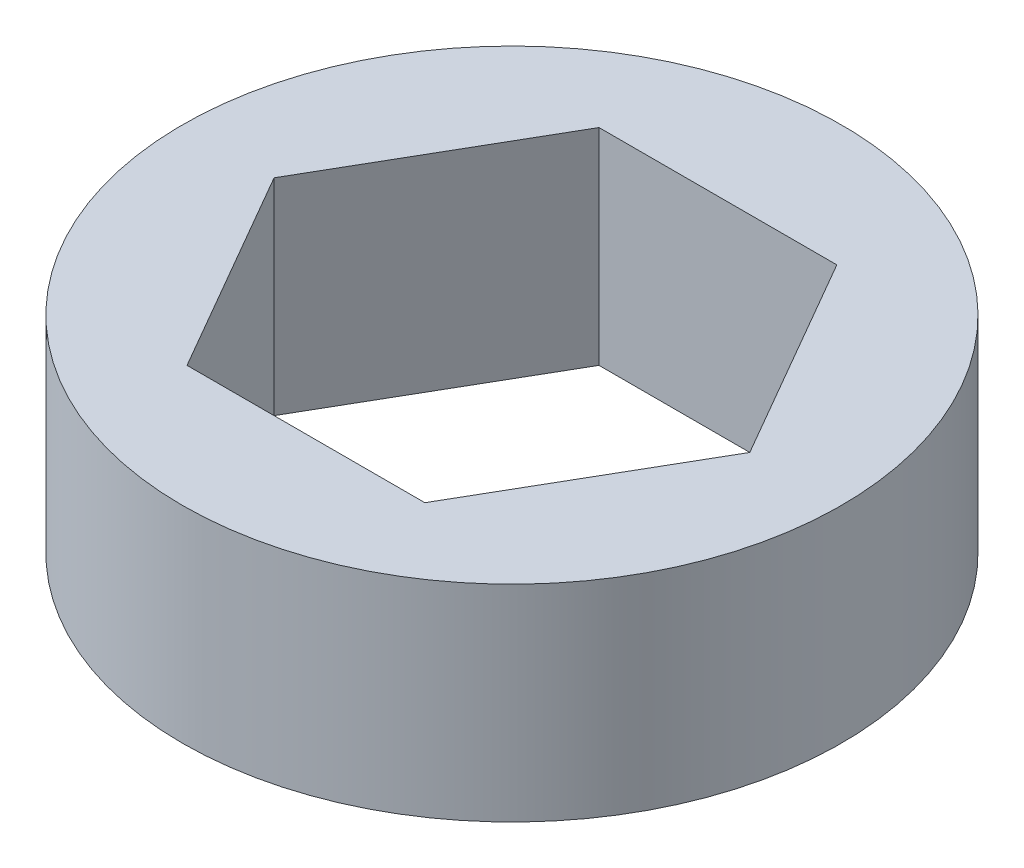
ISO-10303-21;
HEADER;
FILE_DESCRIPTION(('STEP AP214'),'2;1');
FILE_NAME('part.step','',(''),(''),'','','');
FILE_SCHEMA(('AUTOMOTIVE_DESIGN { 1 0 10303 214 1 1 1 1 }'));
ENDSEC;
DATA;
#1=APPLICATION_CONTEXT('core data for automotive mechanical design processes');
#2=APPLICATION_PROTOCOL_DEFINITION('international standard','automotive_design',2000,#1);
#3=PRODUCT_CONTEXT('',#1,'mechanical');
#4=PRODUCT('Part','Part','',(#3));
#5=PRODUCT_RELATED_PRODUCT_CATEGORY('part','',(#4));
#6=PRODUCT_DEFINITION_FORMATION('','',#4);
#7=PRODUCT_DEFINITION_CONTEXT('part definition',#1,'design');
#8=PRODUCT_DEFINITION('design','',#6,#7);
#9=PRODUCT_DEFINITION_SHAPE('','',#8);
#10=(LENGTH_UNIT() NAMED_UNIT(*) SI_UNIT(.MILLI.,.METRE.));
#11=(NAMED_UNIT(*) PLANE_ANGLE_UNIT() SI_UNIT($,.RADIAN.));
#12=(NAMED_UNIT(*) SI_UNIT($,.STERADIAN.) SOLID_ANGLE_UNIT());
#13=UNCERTAINTY_MEASURE_WITH_UNIT(LENGTH_MEASURE(1.E-05),#10,'distance_accuracy_value','');
#14=(GEOMETRIC_REPRESENTATION_CONTEXT(3) GLOBAL_UNCERTAINTY_ASSIGNED_CONTEXT((#13)) GLOBAL_UNIT_ASSIGNED_CONTEXT((#10,
#11,#12)) REPRESENTATION_CONTEXT('',''));
#15=CARTESIAN_POINT('',(0.,0.,0.));
#16=DIRECTION('',(0.,0.,1.));
#17=DIRECTION('',(1.,0.,0.));
#18=AXIS2_PLACEMENT_3D('',#15,#16,#17);
#19=CARTESIAN_POINT('',(0.,6.35,0.));
#20=DIRECTION('',(0.,1.,0.));
#21=DIRECTION('',(0.,0.,1.));
#22=AXIS2_PLACEMENT_3D('',#19,#20,#21);
#23=PLANE('',#22);
#24=CARTESIAN_POINT('',(0.,6.35,0.));
#25=DIRECTION('',(0.,1.,0.));
#26=DIRECTION('',(0.,0.,1.));
#27=AXIS2_PLACEMENT_3D('',#24,#25,#26);
#28=CIRCLE('',#27,10.16);
#29=CARTESIAN_POINT('',(0.,6.35,10.16));
#30=VERTEX_POINT('',#29);
#31=EDGE_CURVE('E11',#30,#30,#28,.T.);
#32=ORIENTED_EDGE('',*,*,#31,.T.);
#33=EDGE_LOOP('',(#32));
#34=FACE_BOUND('',#33,.T.);
#35=DIRECTION('',(-0.500000000000001,0.,-0.866025403784438));
#36=VECTOR('',#35,1.);
#37=CARTESIAN_POINT('',(7.33234841870825,6.35,0.));
#38=LINE('',#37,#36);
#39=CARTESIAN_POINT('',(7.33234841870825,6.35,0.));
#40=VERTEX_POINT('',#39);
#41=CARTESIAN_POINT('',(3.66617420935411,6.35,-6.35000000000001));
#42=VERTEX_POINT('',#41);
#43=EDGE_CURVE('E93',#40,#42,#38,.T.);
#44=ORIENTED_EDGE('',*,*,#43,.F.);
#45=DIRECTION('',(0.499999999999995,0.,-0.866025403784442));
#46=VECTOR('',#45,1.);
#47=CARTESIAN_POINT('',(3.6661742093542,6.35,6.34999999999996));
#48=LINE('',#47,#46);
#49=CARTESIAN_POINT('',(3.6661742093542,6.35,6.34999999999996));
#50=VERTEX_POINT('',#49);
#51=EDGE_CURVE('E85',#50,#40,#48,.T.);
#52=ORIENTED_EDGE('',*,*,#51,.F.);
#53=DIRECTION('',(1.,0.,0.));
#54=VECTOR('',#53,1.);
#55=CARTESIAN_POINT('',(-3.66617420935407,6.35,6.35000000000004));
#56=LINE('',#55,#54);
#57=CARTESIAN_POINT('',(-3.66617420935407,6.35,6.35000000000004));
#58=VERTEX_POINT('',#57);
#59=EDGE_CURVE('E113',#58,#50,#56,.T.);
#60=ORIENTED_EDGE('',*,*,#59,.F.);
#61=DIRECTION('',(0.500000000000007,0.,0.866025403784435));
#62=VECTOR('',#61,1.);
#63=CARTESIAN_POINT('',(-7.33234841870825,6.35,0.));
#64=LINE('',#63,#62);
#65=CARTESIAN_POINT('',(-7.33234841870825,6.35,0.));
#66=VERTEX_POINT('',#65);
#67=EDGE_CURVE('E111',#66,#58,#64,.T.);
#68=ORIENTED_EDGE('',*,*,#67,.F.);
#69=DIRECTION('',(-0.499999999999995,0.,0.866025403784442));
#70=VECTOR('',#69,1.);
#71=CARTESIAN_POINT('',(-3.66617420935416,6.35,-6.34999999999999));
#72=LINE('',#71,#70);
#73=CARTESIAN_POINT('',(-3.66617420935416,6.35,-6.34999999999999));
#74=VERTEX_POINT('',#73);
#75=EDGE_CURVE('E107',#74,#66,#72,.T.);
#76=ORIENTED_EDGE('',*,*,#75,.F.);
#77=DIRECTION('',(-1.,0.,0.));
#78=VECTOR('',#77,1.);
#79=CARTESIAN_POINT('',(3.66617420935411,6.35,-6.35000000000001));
#80=LINE('',#79,#78);
#81=EDGE_CURVE('E105',#42,#74,#80,.T.);
#82=ORIENTED_EDGE('',*,*,#81,.F.);
#83=EDGE_LOOP('',(#44,#52,#60,#68,#76,#82));
#84=FACE_BOUND('',#83,.T.);
#85=ADVANCED_FACE('F32',(#34,#84),#23,.T.);
#86=CARTESIAN_POINT('',(0.,0.,0.));
#87=DIRECTION('',(0.,1.,0.));
#88=DIRECTION('',(0.,0.,1.));
#89=AXIS2_PLACEMENT_3D('',#86,#87,#88);
#90=PLANE('',#89);
#91=CARTESIAN_POINT('',(0.,0.,0.));
#92=DIRECTION('',(0.,1.,0.));
#93=DIRECTION('',(0.,0.,1.));
#94=AXIS2_PLACEMENT_3D('',#91,#92,#93);
#95=CIRCLE('',#94,10.16);
#96=CARTESIAN_POINT('',(0.,0.,10.16));
#97=VERTEX_POINT('',#96);
#98=EDGE_CURVE('E36',#97,#97,#95,.T.);
#99=ORIENTED_EDGE('',*,*,#98,.F.);
#100=EDGE_LOOP('',(#99));
#101=FACE_BOUND('',#100,.T.);
#102=DIRECTION('',(0.499999999999995,0.,-0.866025403784442));
#103=VECTOR('',#102,1.);
#104=CARTESIAN_POINT('',(3.6661742093542,0.,6.34999999999996));
#105=LINE('',#104,#103);
#106=CARTESIAN_POINT('',(3.6661742093542,0.,6.34999999999996));
#107=VERTEX_POINT('',#106);
#108=CARTESIAN_POINT('',(7.33234841870825,0.,0.));
#109=VERTEX_POINT('',#108);
#110=EDGE_CURVE('E55',#107,#109,#105,.T.);
#111=ORIENTED_EDGE('',*,*,#110,.T.);
#112=DIRECTION('',(-0.500000000000001,0.,-0.866025403784438));
#113=VECTOR('',#112,1.);
#114=CARTESIAN_POINT('',(7.33234841870825,0.,0.));
#115=LINE('',#114,#113);
#116=CARTESIAN_POINT('',(3.66617420935411,0.,-6.35000000000001));
#117=VERTEX_POINT('',#116);
#118=EDGE_CURVE('E100',#109,#117,#115,.T.);
#119=ORIENTED_EDGE('',*,*,#118,.T.);
#120=DIRECTION('',(-1.,0.,0.));
#121=VECTOR('',#120,1.);
#122=CARTESIAN_POINT('',(3.66617420935411,0.,-6.35000000000001));
#123=LINE('',#122,#121);
#124=CARTESIAN_POINT('',(-3.66617420935416,0.,-6.34999999999999));
#125=VERTEX_POINT('',#124);
#126=EDGE_CURVE('E117',#117,#125,#123,.T.);
#127=ORIENTED_EDGE('',*,*,#126,.T.);
#128=DIRECTION('',(-0.499999999999995,0.,0.866025403784442));
#129=VECTOR('',#128,1.);
#130=CARTESIAN_POINT('',(-3.66617420935416,0.,-6.34999999999999));
#131=LINE('',#130,#129);
#132=CARTESIAN_POINT('',(-7.33234841870825,0.,0.));
#133=VERTEX_POINT('',#132);
#134=EDGE_CURVE('E120',#125,#133,#131,.T.);
#135=ORIENTED_EDGE('',*,*,#134,.T.);
#136=DIRECTION('',(0.500000000000007,0.,0.866025403784435));
#137=VECTOR('',#136,1.);
#138=CARTESIAN_POINT('',(-7.33234841870825,0.,0.));
#139=LINE('',#138,#137);
#140=CARTESIAN_POINT('',(-3.66617420935407,0.,6.35000000000004));
#141=VERTEX_POINT('',#140);
#142=EDGE_CURVE('E123',#133,#141,#139,.T.);
#143=ORIENTED_EDGE('',*,*,#142,.T.);
#144=DIRECTION('',(1.,0.,0.));
#145=VECTOR('',#144,1.);
#146=CARTESIAN_POINT('',(-3.66617420935407,0.,6.35000000000004));
#147=LINE('',#146,#145);
#148=EDGE_CURVE('E94',#141,#107,#147,.T.);
#149=ORIENTED_EDGE('',*,*,#148,.T.);
#150=EDGE_LOOP('',(#111,#119,#127,#135,#143,#149));
#151=FACE_BOUND('',#150,.T.);
#152=ADVANCED_FACE('F140',(#101,#151),#90,.F.);
#153=CARTESIAN_POINT('',(0.,6.35,0.));
#154=DIRECTION('',(0.,-1.,0.));
#155=DIRECTION('',(0.,0.,-1.));
#156=AXIS2_PLACEMENT_3D('',#153,#154,#155);
#157=CYLINDRICAL_SURFACE('',#156,10.16);
#158=ORIENTED_EDGE('',*,*,#31,.F.);
#159=EDGE_LOOP('',(#158));
#160=FACE_BOUND('',#159,.T.);
#161=ORIENTED_EDGE('',*,*,#98,.T.);
#162=EDGE_LOOP('',(#161));
#163=FACE_BOUND('',#162,.T.);
#164=ADVANCED_FACE('F34',(#160,#163),#157,.T.);
#165=CARTESIAN_POINT('',(3.6661742093542,6.35,6.34999999999996));
#166=DIRECTION('',(-0.866025403784441,0.,-0.499999999999995));
#167=DIRECTION('',(-0.499999999999995,0.,0.866025403784442));
#168=AXIS2_PLACEMENT_3D('',#165,#166,#167);
#169=PLANE('',#168);
#170=ORIENTED_EDGE('',*,*,#110,.F.);
#171=DIRECTION('',(0.,-1.,0.));
#172=VECTOR('',#171,1.);
#173=CARTESIAN_POINT('',(3.6661742093542,6.35,6.34999999999996));
#174=LINE('',#173,#172);
#175=EDGE_CURVE('E89',#50,#107,#174,.T.);
#176=ORIENTED_EDGE('',*,*,#175,.F.);
#177=ORIENTED_EDGE('',*,*,#51,.T.);
#178=DIRECTION('',(0.,-1.,0.));
#179=VECTOR('',#178,1.);
#180=CARTESIAN_POINT('',(7.33234841870825,6.35,0.));
#181=LINE('',#180,#179);
#182=EDGE_CURVE('E88',#40,#109,#181,.T.);
#183=ORIENTED_EDGE('',*,*,#182,.T.);
#184=EDGE_LOOP('',(#170,#176,#177,#183));
#185=FACE_BOUND('',#184,.T.);
#186=ADVANCED_FACE('F87',(#185),#169,.T.);
#187=CARTESIAN_POINT('',(7.33234841870825,6.35,0.));
#188=DIRECTION('',(-0.866025403784438,0.,0.500000000000001));
#189=DIRECTION('',(0.500000000000001,0.,0.866025403784438));
#190=AXIS2_PLACEMENT_3D('',#187,#188,#189);
#191=PLANE('',#190);
#192=ORIENTED_EDGE('',*,*,#118,.F.);
#193=ORIENTED_EDGE('',*,*,#182,.F.);
#194=ORIENTED_EDGE('',*,*,#43,.T.);
#195=DIRECTION('',(0.,-1.,0.));
#196=VECTOR('',#195,1.);
#197=CARTESIAN_POINT('',(3.66617420935411,6.35,-6.35000000000001));
#198=LINE('',#197,#196);
#199=EDGE_CURVE('E101',#42,#117,#198,.T.);
#200=ORIENTED_EDGE('',*,*,#199,.T.);
#201=EDGE_LOOP('',(#192,#193,#194,#200));
#202=FACE_BOUND('',#201,.T.);
#203=ADVANCED_FACE('F97',(#202),#191,.T.);
#204=CARTESIAN_POINT('',(3.66617420935411,6.35,-6.35000000000001));
#205=DIRECTION('',(0.,0.,1.));
#206=DIRECTION('',(1.,0.,0.));
#207=AXIS2_PLACEMENT_3D('',#204,#205,#206);
#208=PLANE('',#207);
#209=ORIENTED_EDGE('',*,*,#126,.F.);
#210=ORIENTED_EDGE('',*,*,#199,.F.);
#211=ORIENTED_EDGE('',*,*,#81,.T.);
#212=DIRECTION('',(0.,-1.,0.));
#213=VECTOR('',#212,1.);
#214=CARTESIAN_POINT('',(-3.66617420935416,6.35,-6.34999999999999));
#215=LINE('',#214,#213);
#216=EDGE_CURVE('E132',#74,#125,#215,.T.);
#217=ORIENTED_EDGE('',*,*,#216,.T.);
#218=EDGE_LOOP('',(#209,#210,#211,#217));
#219=FACE_BOUND('',#218,.T.);
#220=ADVANCED_FACE('F136',(#219),#208,.T.);
#221=CARTESIAN_POINT('',(-3.66617420935416,6.35,-6.34999999999999));
#222=DIRECTION('',(0.866025403784442,0.,0.499999999999995));
#223=DIRECTION('',(0.499999999999995,0.,-0.866025403784442));
#224=AXIS2_PLACEMENT_3D('',#221,#222,#223);
#225=PLANE('',#224);
#226=ORIENTED_EDGE('',*,*,#134,.F.);
#227=ORIENTED_EDGE('',*,*,#216,.F.);
#228=ORIENTED_EDGE('',*,*,#75,.T.);
#229=DIRECTION('',(0.,-1.,0.));
#230=VECTOR('',#229,1.);
#231=CARTESIAN_POINT('',(-7.33234841870825,6.35,0.));
#232=LINE('',#231,#230);
#233=EDGE_CURVE('E130',#66,#133,#232,.T.);
#234=ORIENTED_EDGE('',*,*,#233,.T.);
#235=EDGE_LOOP('',(#226,#227,#228,#234));
#236=FACE_BOUND('',#235,.T.);
#237=ADVANCED_FACE('F148',(#236),#225,.T.);
#238=CARTESIAN_POINT('',(-7.33234841870825,6.35,0.));
#239=DIRECTION('',(0.866025403784435,0.,-0.500000000000007));
#240=DIRECTION('',(-0.500000000000007,0.,-0.866025403784435));
#241=AXIS2_PLACEMENT_3D('',#238,#239,#240);
#242=PLANE('',#241);
#243=ORIENTED_EDGE('',*,*,#142,.F.);
#244=ORIENTED_EDGE('',*,*,#233,.F.);
#245=ORIENTED_EDGE('',*,*,#67,.T.);
#246=DIRECTION('',(0.,-1.,0.));
#247=VECTOR('',#246,1.);
#248=CARTESIAN_POINT('',(-3.66617420935407,6.35,6.35000000000004));
#249=LINE('',#248,#247);
#250=EDGE_CURVE('E47',#58,#141,#249,.T.);
#251=ORIENTED_EDGE('',*,*,#250,.T.);
#252=EDGE_LOOP('',(#243,#244,#245,#251));
#253=FACE_BOUND('',#252,.T.);
#254=ADVANCED_FACE('F146',(#253),#242,.T.);
#255=CARTESIAN_POINT('',(-3.66617420935407,6.35,6.35000000000004));
#256=DIRECTION('',(0.,0.,-1.));
#257=DIRECTION('',(-1.,0.,0.));
#258=AXIS2_PLACEMENT_3D('',#255,#256,#257);
#259=PLANE('',#258);
#260=ORIENTED_EDGE('',*,*,#148,.F.);
#261=ORIENTED_EDGE('',*,*,#250,.F.);
#262=ORIENTED_EDGE('',*,*,#59,.T.);
#263=ORIENTED_EDGE('',*,*,#175,.T.);
#264=EDGE_LOOP('',(#260,#261,#262,#263));
#265=FACE_BOUND('',#264,.T.);
#266=ADVANCED_FACE('F142',(#265),#259,.T.);
#267=CLOSED_SHELL('',(#85,#152,#164,#186,#203,#220,#237,#254,#266));
#268=MANIFOLD_SOLID_BREP('B2',#267);
#269=ADVANCED_BREP_SHAPE_REPRESENTATION('',(#18,#268),#14);
#270=SHAPE_DEFINITION_REPRESENTATION(#9,#269);
ENDSEC;
END-ISO-10303-21;
